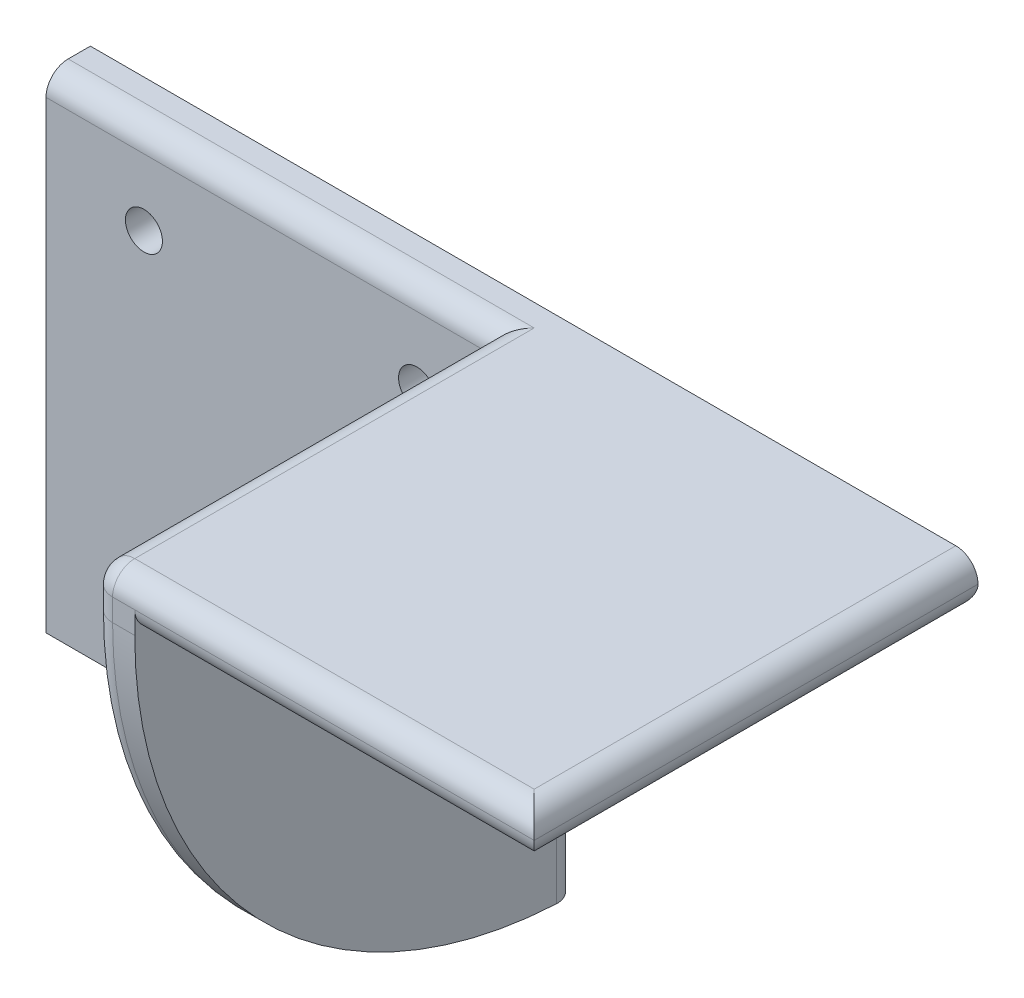
ISO-10303-21;
HEADER;
FILE_DESCRIPTION(('STEP AP214'),'2;1');
FILE_NAME('part.step','',(''),(''),'','','');
FILE_SCHEMA(('AUTOMOTIVE_DESIGN { 1 0 10303 214 1 1 1 1 }'));
ENDSEC;
DATA;
#1=APPLICATION_CONTEXT('core data for automotive mechanical design processes');
#2=APPLICATION_PROTOCOL_DEFINITION('international standard','automotive_design',2000,#1);
#3=PRODUCT_CONTEXT('',#1,'mechanical');
#4=PRODUCT('Part','Part','',(#3));
#5=PRODUCT_RELATED_PRODUCT_CATEGORY('part','',(#4));
#6=PRODUCT_DEFINITION_FORMATION('','',#4);
#7=PRODUCT_DEFINITION_CONTEXT('part definition',#1,'design');
#8=PRODUCT_DEFINITION('design','',#6,#7);
#9=PRODUCT_DEFINITION_SHAPE('','',#8);
#10=(LENGTH_UNIT() NAMED_UNIT(*) SI_UNIT(.MILLI.,.METRE.));
#11=(NAMED_UNIT(*) PLANE_ANGLE_UNIT() SI_UNIT($,.RADIAN.));
#12=(NAMED_UNIT(*) SI_UNIT($,.STERADIAN.) SOLID_ANGLE_UNIT());
#13=UNCERTAINTY_MEASURE_WITH_UNIT(LENGTH_MEASURE(1.E-05),#10,'distance_accuracy_value','');
#14=(GEOMETRIC_REPRESENTATION_CONTEXT(3) GLOBAL_UNCERTAINTY_ASSIGNED_CONTEXT((#13)) GLOBAL_UNIT_ASSIGNED_CONTEXT((#10,
#11,#12)) REPRESENTATION_CONTEXT('',''));
#15=CARTESIAN_POINT('',(0.,0.,0.));
#16=DIRECTION('',(0.,0.,1.));
#17=DIRECTION('',(1.,0.,0.));
#18=AXIS2_PLACEMENT_3D('',#15,#16,#17);
#19=CARTESIAN_POINT('',(-30.,6.,30.));
#20=DIRECTION('',(1.,0.,0.));
#21=DIRECTION('',(0.,0.,-1.));
#22=AXIS2_PLACEMENT_3D('',#19,#20,#21);
#23=PLANE('',#22);
#24=DIRECTION('',(0.,1.,0.));
#25=VECTOR('',#24,1.);
#26=CARTESIAN_POINT('',(-30.,6.,-24.));
#27=LINE('',#26,#25);
#28=CARTESIAN_POINT('',(-30.,-56.6833308830736,-24.));
#29=VERTEX_POINT('',#28);
#30=CARTESIAN_POINT('',(-30.,3.,-24.));
#31=VERTEX_POINT('',#30);
#32=EDGE_CURVE('E169',#29,#31,#27,.T.);
#33=ORIENTED_EDGE('',*,*,#32,.F.);
#34=CARTESIAN_POINT('',(-30.,0.,-30.));
#35=DIRECTION('',(1.,0.,0.));
#36=DIRECTION('',(0.,0.,-1.));
#37=AXIS2_PLACEMENT_3D('',#34,#35,#36);
#38=CIRCLE('',#37,57.);
#39=CARTESIAN_POINT('',(-30.,0.,27.));
#40=VERTEX_POINT('',#39);
#41=EDGE_CURVE('E357',#29,#40,#38,.F.);
#42=ORIENTED_EDGE('',*,*,#41,.T.);
#43=DIRECTION('',(0.,-1.,0.));
#44=VECTOR('',#43,1.);
#45=CARTESIAN_POINT('',(-30.,6.,27.));
#46=LINE('',#45,#44);
#47=CARTESIAN_POINT('',(-30.,3.,27.));
#48=VERTEX_POINT('',#47);
#49=EDGE_CURVE('E361',#40,#48,#46,.F.);
#50=ORIENTED_EDGE('',*,*,#49,.T.);
#51=DIRECTION('',(0.,0.,1.));
#52=VECTOR('',#51,1.);
#53=CARTESIAN_POINT('',(-30.,3.,30.));
#54=LINE('',#53,#52);
#55=EDGE_CURVE('E419',#48,#31,#54,.F.);
#56=ORIENTED_EDGE('',*,*,#55,.T.);
#57=EDGE_LOOP('',(#33,#42,#50,#56));
#58=FACE_BOUND('',#57,.T.);
#59=ADVANCED_FACE('F40',(#58),#23,.F.);
#60=CARTESIAN_POINT('',(-30.,6.,-30.));
#61=DIRECTION('',(0.,0.,1.));
#62=DIRECTION('',(1.,0.,0.));
#63=AXIS2_PLACEMENT_3D('',#60,#61,#62);
#64=PLANE('',#63);
#65=CARTESIAN_POINT('',(-39.8380749845108,-5.98781515653882,-30.));
#66=DIRECTION('',(0.,0.,1.));
#67=DIRECTION('',(1.,0.,0.));
#68=AXIS2_PLACEMENT_3D('',#65,#66,#67);
#69=CIRCLE('',#68,2.5);
#70=CARTESIAN_POINT('',(-37.3380749845108,-5.98781515653882,-30.));
#71=VERTEX_POINT('',#70);
#72=EDGE_CURVE('E298',#71,#71,#69,.T.);
#73=ORIENTED_EDGE('',*,*,#72,.T.);
#74=EDGE_LOOP('',(#73));
#75=FACE_BOUND('',#74,.T.);
#76=CARTESIAN_POINT('',(-76.7612206053908,-53.5992397729367,-30.));
#77=DIRECTION('',(0.,0.,1.));
#78=DIRECTION('',(1.,0.,0.));
#79=AXIS2_PLACEMENT_3D('',#76,#77,#78);
#80=CIRCLE('',#79,2.50000000000001);
#81=CARTESIAN_POINT('',(-74.2612206053908,-53.5992397729367,-30.));
#82=VERTEX_POINT('',#81);
#83=EDGE_CURVE('E302',#82,#82,#80,.T.);
#84=ORIENTED_EDGE('',*,*,#83,.T.);
#85=EDGE_LOOP('',(#84));
#86=FACE_BOUND('',#85,.T.);
#87=CARTESIAN_POINT('',(-39.8380749845108,-53.3563243412204,-30.));
#88=DIRECTION('',(0.,0.,1.));
#89=DIRECTION('',(1.,0.,0.));
#90=AXIS2_PLACEMENT_3D('',#87,#88,#89);
#91=CIRCLE('',#90,2.5);
#92=CARTESIAN_POINT('',(-37.3380749845108,-53.3563243412204,-30.));
#93=VERTEX_POINT('',#92);
#94=EDGE_CURVE('E306',#93,#93,#91,.T.);
#95=ORIENTED_EDGE('',*,*,#94,.T.);
#96=EDGE_LOOP('',(#95));
#97=FACE_BOUND('',#96,.T.);
#98=CARTESIAN_POINT('',(-76.7612206053908,-5.98781515653882,-30.));
#99=DIRECTION('',(0.,0.,1.));
#100=DIRECTION('',(1.,0.,0.));
#101=AXIS2_PLACEMENT_3D('',#98,#99,#100);
#102=CIRCLE('',#101,2.50000000000001);
#103=CARTESIAN_POINT('',(-74.2612206053908,-5.98781515653882,-30.));
#104=VERTEX_POINT('',#103);
#105=EDGE_CURVE('E174',#104,#104,#102,.T.);
#106=ORIENTED_EDGE('',*,*,#105,.T.);
#107=EDGE_LOOP('',(#106));
#108=FACE_BOUND('',#107,.T.);
#109=DIRECTION('',(-1.,0.,0.));
#110=VECTOR('',#109,1.);
#111=CARTESIAN_POINT('',(-30.,6.,-30.));
#112=LINE('',#111,#110);
#113=CARTESIAN_POINT('',(27.,6.,-30.));
#114=VERTEX_POINT('',#113);
#115=CARTESIAN_POINT('',(-90.,6.,-30.));
#116=VERTEX_POINT('',#115);
#117=EDGE_CURVE('E152',#114,#116,#112,.T.);
#118=ORIENTED_EDGE('',*,*,#117,.F.);
#119=CARTESIAN_POINT('',(27.,3.,-30.));
#120=DIRECTION('',(0.,0.,1.));
#121=DIRECTION('',(1.,0.,0.));
#122=AXIS2_PLACEMENT_3D('',#119,#120,#121);
#123=CIRCLE('',#122,3.);
#124=CARTESIAN_POINT('',(30.,3.,-30.));
#125=VERTEX_POINT('',#124);
#126=EDGE_CURVE('E50',#114,#125,#123,.F.);
#127=ORIENTED_EDGE('',*,*,#126,.T.);
#128=DIRECTION('',(-1.,0.,0.));
#129=VECTOR('',#128,1.);
#130=CARTESIAN_POINT('',(-24.,3.,-30.));
#131=LINE('',#130,#129);
#132=CARTESIAN_POINT('',(-27.,3.,-30.));
#133=VERTEX_POINT('',#132);
#134=EDGE_CURVE('E209',#125,#133,#131,.T.);
#135=ORIENTED_EDGE('',*,*,#134,.T.);
#136=DIRECTION('',(0.,1.,0.));
#137=VECTOR('',#136,1.);
#138=CARTESIAN_POINT('',(-27.,6.,-30.));
#139=LINE('',#138,#137);
#140=CARTESIAN_POINT('',(-27.,-60.,-30.));
#141=VERTEX_POINT('',#140);
#142=EDGE_CURVE('E159',#133,#141,#139,.F.);
#143=ORIENTED_EDGE('',*,*,#142,.T.);
#144=DIRECTION('',(1.,0.,0.));
#145=VECTOR('',#144,1.);
#146=CARTESIAN_POINT('',(-30.,-60.,-30.));
#147=LINE('',#146,#145);
#148=CARTESIAN_POINT('',(-90.,-60.,-30.));
#149=VERTEX_POINT('',#148);
#150=EDGE_CURVE('E143',#149,#141,#147,.T.);
#151=ORIENTED_EDGE('',*,*,#150,.F.);
#152=DIRECTION('',(0.,-1.,0.));
#153=VECTOR('',#152,1.);
#154=CARTESIAN_POINT('',(-90.,6.,-30.));
#155=LINE('',#154,#153);
#156=EDGE_CURVE('E157',#116,#149,#155,.T.);
#157=ORIENTED_EDGE('',*,*,#156,.F.);
#158=EDGE_LOOP('',(#118,#127,#135,#143,#151,#157));
#159=FACE_BOUND('',#158,.T.);
#160=ADVANCED_FACE('F156',(#75,#86,#97,#108,#159),#64,.F.);
#161=CARTESIAN_POINT('',(-30.,6.,30.));
#162=DIRECTION('',(0.,0.,-1.));
#163=DIRECTION('',(-1.,0.,0.));
#164=AXIS2_PLACEMENT_3D('',#161,#162,#163);
#165=PLANE('',#164);
#166=DIRECTION('',(1.,0.,0.));
#167=VECTOR('',#166,1.);
#168=CARTESIAN_POINT('',(-30.,3.,30.));
#169=LINE('',#168,#167);
#170=CARTESIAN_POINT('',(-24.,3.,30.));
#171=VERTEX_POINT('',#170);
#172=CARTESIAN_POINT('',(-27.,3.,30.));
#173=VERTEX_POINT('',#172);
#174=EDGE_CURVE('E372',#171,#173,#169,.F.);
#175=ORIENTED_EDGE('',*,*,#174,.T.);
#176=DIRECTION('',(0.,-1.,0.));
#177=VECTOR('',#176,1.);
#178=CARTESIAN_POINT('',(-27.,6.,30.));
#179=LINE('',#178,#177);
#180=CARTESIAN_POINT('',(-27.,0.,30.));
#181=VERTEX_POINT('',#180);
#182=EDGE_CURVE('E378',#173,#181,#179,.T.);
#183=ORIENTED_EDGE('',*,*,#182,.T.);
#184=DIRECTION('',(-1.,0.,0.));
#185=VECTOR('',#184,1.);
#186=CARTESIAN_POINT('',(-24.,0.,30.));
#187=LINE('',#186,#185);
#188=CARTESIAN_POINT('',(-24.,0.,30.));
#189=VERTEX_POINT('',#188);
#190=EDGE_CURVE('E189',#181,#189,#187,.F.);
#191=ORIENTED_EDGE('',*,*,#190,.T.);
#192=DIRECTION('',(0.,1.,0.));
#193=VECTOR('',#192,1.);
#194=CARTESIAN_POINT('',(-24.,6.,30.));
#195=LINE('',#194,#193);
#196=EDGE_CURVE('E401',#189,#171,#195,.T.);
#197=ORIENTED_EDGE('',*,*,#196,.T.);
#198=EDGE_LOOP('',(#175,#183,#191,#197));
#199=FACE_BOUND('',#198,.T.);
#200=ADVANCED_FACE('F282',(#199),#165,.F.);
#201=CARTESIAN_POINT('',(0.,6.,0.));
#202=DIRECTION('',(0.,-1.,0.));
#203=DIRECTION('',(0.,0.,-1.));
#204=AXIS2_PLACEMENT_3D('',#201,#202,#203);
#205=PLANE('',#204);
#206=DIRECTION('',(1.,0.,0.));
#207=VECTOR('',#206,1.);
#208=CARTESIAN_POINT('',(0.,6.,27.));
#209=LINE('',#208,#207);
#210=CARTESIAN_POINT('',(-27.,6.,27.));
#211=VERTEX_POINT('',#210);
#212=CARTESIAN_POINT('',(27.,6.,27.));
#213=VERTEX_POINT('',#212);
#214=EDGE_CURVE('E58',#211,#213,#209,.T.);
#215=ORIENTED_EDGE('',*,*,#214,.T.);
#216=DIRECTION('',(0.,0.,-1.));
#217=VECTOR('',#216,1.);
#218=CARTESIAN_POINT('',(27.,6.,0.));
#219=LINE('',#218,#217);
#220=EDGE_CURVE('E62',#213,#114,#219,.T.);
#221=ORIENTED_EDGE('',*,*,#220,.T.);
#222=ORIENTED_EDGE('',*,*,#117,.T.);
#223=DIRECTION('',(0.,0.,-1.));
#224=VECTOR('',#223,1.);
#225=CARTESIAN_POINT('',(-90.,6.,-30.));
#226=LINE('',#225,#224);
#227=CARTESIAN_POINT('',(-90.,6.,-27.));
#228=VERTEX_POINT('',#227);
#229=EDGE_CURVE('E166',#228,#116,#226,.T.);
#230=ORIENTED_EDGE('',*,*,#229,.F.);
#231=DIRECTION('',(1.,0.,0.));
#232=VECTOR('',#231,1.);
#233=CARTESIAN_POINT('',(0.,6.,-27.));
#234=LINE('',#233,#232);
#235=CARTESIAN_POINT('',(-27.,6.,-27.));
#236=VERTEX_POINT('',#235);
#237=EDGE_CURVE('E196',#228,#236,#234,.T.);
#238=ORIENTED_EDGE('',*,*,#237,.T.);
#239=DIRECTION('',(0.,0.,1.));
#240=VECTOR('',#239,1.);
#241=CARTESIAN_POINT('',(-27.,6.,0.));
#242=LINE('',#241,#240);
#243=EDGE_CURVE('E415',#236,#211,#242,.T.);
#244=ORIENTED_EDGE('',*,*,#243,.T.);
#245=EDGE_LOOP('',(#215,#221,#222,#230,#238,#244));
#246=FACE_BOUND('',#245,.T.);
#247=ADVANCED_FACE('F279',(#246),#205,.F.);
#248=CARTESIAN_POINT('',(0.,0.,0.));
#249=DIRECTION('',(0.,-1.,0.));
#250=DIRECTION('',(0.,0.,-1.));
#251=AXIS2_PLACEMENT_3D('',#248,#249,#250);
#252=PLANE('',#251);
#253=DIRECTION('',(0.,0.,1.));
#254=VECTOR('',#253,1.);
#255=CARTESIAN_POINT('',(-24.,0.,30.));
#256=LINE('',#255,#254);
#257=CARTESIAN_POINT('',(-24.,0.,-27.));
#258=VERTEX_POINT('',#257);
#259=CARTESIAN_POINT('',(-24.,0.,27.));
#260=VERTEX_POINT('',#259);
#261=EDGE_CURVE('E161',#258,#260,#256,.T.);
#262=ORIENTED_EDGE('',*,*,#261,.F.);
#263=DIRECTION('',(-1.,0.,0.));
#264=VECTOR('',#263,1.);
#265=CARTESIAN_POINT('',(30.,0.,-27.));
#266=LINE('',#265,#264);
#267=CARTESIAN_POINT('',(27.,0.,-27.));
#268=VERTEX_POINT('',#267);
#269=EDGE_CURVE('E402',#258,#268,#266,.F.);
#270=ORIENTED_EDGE('',*,*,#269,.T.);
#271=DIRECTION('',(0.,0.,-1.));
#272=VECTOR('',#271,1.);
#273=CARTESIAN_POINT('',(27.,0.,30.));
#274=LINE('',#273,#272);
#275=CARTESIAN_POINT('',(27.,0.,27.));
#276=VERTEX_POINT('',#275);
#277=EDGE_CURVE('E396',#268,#276,#274,.F.);
#278=ORIENTED_EDGE('',*,*,#277,.T.);
#279=DIRECTION('',(1.,0.,0.));
#280=VECTOR('',#279,1.);
#281=CARTESIAN_POINT('',(-24.,0.,27.));
#282=LINE('',#281,#280);
#283=EDGE_CURVE('E223',#276,#260,#282,.F.);
#284=ORIENTED_EDGE('',*,*,#283,.T.);
#285=EDGE_LOOP('',(#262,#270,#278,#284));
#286=FACE_BOUND('',#285,.T.);
#287=ADVANCED_FACE('F277',(#286),#252,.T.);
#288=CARTESIAN_POINT('',(-24.,-60.,30.));
#289=DIRECTION('',(-1.,0.,0.));
#290=DIRECTION('',(0.,0.,1.));
#291=AXIS2_PLACEMENT_3D('',#288,#289,#290);
#292=PLANE('',#291);
#293=CARTESIAN_POINT('',(-24.,0.,-30.));
#294=DIRECTION('',(-1.,0.,0.));
#295=DIRECTION('',(0.,0.,1.));
#296=AXIS2_PLACEMENT_3D('',#293,#294,#295);
#297=CIRCLE('',#296,60.);
#298=CARTESIAN_POINT('',(-24.,-59.9249530663145,-27.));
#299=VERTEX_POINT('',#298);
#300=EDGE_CURVE('E192',#189,#299,#297,.F.);
#301=ORIENTED_EDGE('',*,*,#300,.T.);
#302=DIRECTION('',(0.,1.,0.));
#303=VECTOR('',#302,1.);
#304=CARTESIAN_POINT('',(-24.,-60.,-27.));
#305=LINE('',#304,#303);
#306=EDGE_CURVE('E205',#299,#258,#305,.T.);
#307=ORIENTED_EDGE('',*,*,#306,.T.);
#308=ORIENTED_EDGE('',*,*,#261,.T.);
#309=CARTESIAN_POINT('',(-24.,3.,27.));
#310=DIRECTION('',(-1.,0.,0.));
#311=DIRECTION('',(0.,0.,1.));
#312=AXIS2_PLACEMENT_3D('',#309,#310,#311);
#313=CIRCLE('',#312,3.);
#314=EDGE_CURVE('E413',#260,#171,#313,.T.);
#315=ORIENTED_EDGE('',*,*,#314,.T.);
#316=ORIENTED_EDGE('',*,*,#196,.F.);
#317=EDGE_LOOP('',(#301,#307,#308,#315,#316));
#318=FACE_BOUND('',#317,.T.);
#319=ADVANCED_FACE('F272',(#318),#292,.F.);
#320=CARTESIAN_POINT('',(-90.,6.,-24.));
#321=DIRECTION('',(0.,0.,-1.));
#322=DIRECTION('',(-1.,0.,0.));
#323=AXIS2_PLACEMENT_3D('',#320,#321,#322);
#324=PLANE('',#323);
#325=CARTESIAN_POINT('',(-39.8380749845108,-5.98781515653882,-24.));
#326=DIRECTION('',(0.,0.,1.));
#327=DIRECTION('',(1.,0.,0.));
#328=AXIS2_PLACEMENT_3D('',#325,#326,#327);
#329=CIRCLE('',#328,2.5);
#330=CARTESIAN_POINT('',(-37.3380749845108,-5.98781515653882,-24.));
#331=VERTEX_POINT('',#330);
#332=EDGE_CURVE('E320',#331,#331,#329,.T.);
#333=ORIENTED_EDGE('',*,*,#332,.F.);
#334=EDGE_LOOP('',(#333));
#335=FACE_BOUND('',#334,.T.);
#336=CARTESIAN_POINT('',(-76.7612206053908,-53.5992397729367,-24.));
#337=DIRECTION('',(0.,0.,1.));
#338=DIRECTION('',(1.,0.,0.));
#339=AXIS2_PLACEMENT_3D('',#336,#337,#338);
#340=CIRCLE('',#339,2.50000000000001);
#341=CARTESIAN_POINT('',(-74.2612206053908,-53.5992397729367,-24.));
#342=VERTEX_POINT('',#341);
#343=EDGE_CURVE('E314',#342,#342,#340,.T.);
#344=ORIENTED_EDGE('',*,*,#343,.F.);
#345=EDGE_LOOP('',(#344));
#346=FACE_BOUND('',#345,.T.);
#347=CARTESIAN_POINT('',(-39.8380749845108,-53.3563243412204,-24.));
#348=DIRECTION('',(0.,0.,1.));
#349=DIRECTION('',(1.,0.,0.));
#350=AXIS2_PLACEMENT_3D('',#347,#348,#349);
#351=CIRCLE('',#350,2.5);
#352=CARTESIAN_POINT('',(-37.3380749845108,-53.3563243412204,-24.));
#353=VERTEX_POINT('',#352);
#354=EDGE_CURVE('E326',#353,#353,#351,.T.);
#355=ORIENTED_EDGE('',*,*,#354,.F.);
#356=EDGE_LOOP('',(#355));
#357=FACE_BOUND('',#356,.T.);
#358=CARTESIAN_POINT('',(-76.7612206053908,-5.98781515653882,-24.));
#359=DIRECTION('',(0.,0.,1.));
#360=DIRECTION('',(1.,0.,0.));
#361=AXIS2_PLACEMENT_3D('',#358,#359,#360);
#362=CIRCLE('',#361,2.50000000000001);
#363=CARTESIAN_POINT('',(-74.2612206053908,-5.98781515653882,-24.));
#364=VERTEX_POINT('',#363);
#365=EDGE_CURVE('E177',#364,#364,#362,.T.);
#366=ORIENTED_EDGE('',*,*,#365,.F.);
#367=EDGE_LOOP('',(#366));
#368=FACE_BOUND('',#367,.T.);
#369=DIRECTION('',(1.,0.,0.));
#370=VECTOR('',#369,1.);
#371=CARTESIAN_POINT('',(-90.,-59.6992462263972,-24.));
#372=LINE('',#371,#370);
#373=CARTESIAN_POINT('',(-90.,-59.6992462263972,-24.));
#374=VERTEX_POINT('',#373);
#375=CARTESIAN_POINT('',(-27.,-59.6992462263972,-24.));
#376=VERTEX_POINT('',#375);
#377=EDGE_CURVE('E146',#374,#376,#372,.T.);
#378=ORIENTED_EDGE('',*,*,#377,.T.);
#379=CARTESIAN_POINT('',(-27.,-59.6992462263972,-24.));
#380=CARTESIAN_POINT('',(-27.0840679412996,-59.6992545648546,-24.));
#381=CARTESIAN_POINT('',(-27.1681319263133,-59.6956947573301,-24.));
#382=CARTESIAN_POINT('',(-27.3356561646389,-59.6815033243546,-24.));
#383=CARTESIAN_POINT('',(-27.4191164524032,-59.6708721057326,-24.));
#384=CARTESIAN_POINT('',(-27.5847733393088,-59.6426149242573,-24.));
#385=CARTESIAN_POINT('',(-27.6669709996589,-59.6249952117223,-24.));
#386=CARTESIAN_POINT('',(-27.8295693639574,-59.5829075774079,-24.));
#387=CARTESIAN_POINT('',(-27.9099700865748,-59.5584397268122,-24.));
#388=CARTESIAN_POINT('',(-28.1476944998591,-59.4749712035964,-24.));
#389=CARTESIAN_POINT('',(-28.3016159485823,-59.4058926018362,-24.));
#390=CARTESIAN_POINT('',(-28.5956016026662,-59.242972373237,-24.));
#391=CARTESIAN_POINT('',(-28.7356677123405,-59.1491341559435,-24.));
#392=CARTESIAN_POINT('',(-28.9984493175101,-58.9391394131622,-24.));
#393=CARTESIAN_POINT('',(-29.1211271395701,-58.8229356762981,-24.));
#394=CARTESIAN_POINT('',(-29.3453622807689,-58.5716459664221,-24.));
#395=CARTESIAN_POINT('',(-29.4469153112062,-58.4365561684999,-24.));
#396=CARTESIAN_POINT('',(-29.6265333506082,-58.1506494891051,-24.));
#397=CARTESIAN_POINT('',(-29.7044793548183,-57.9997579213162,-24.));
#398=CARTESIAN_POINT('',(-29.8340361538481,-57.6871002786585,-24.));
#399=CARTESIAN_POINT('',(-29.8856602731936,-57.5253397528479,-24.));
#400=CARTESIAN_POINT('',(-29.9488793354195,-57.2494563913502,-24.));
#401=CARTESIAN_POINT('',(-29.9680387339994,-57.1370072058581,-24.));
#402=CARTESIAN_POINT('',(-29.993597802028,-56.9108305279191,-24.));
#403=CARTESIAN_POINT('',(-30.0000156101864,-56.7971050847726,-24.));
#404=CARTESIAN_POINT('',(-30.,-56.6833308830736,-24.));
#405=B_SPLINE_CURVE_WITH_KNOTS('',3,(#379,#380,#381,#382,#383,#384,#385,#386,#387,#388,#389,
#390,#391,#392,#393,#394,#395,#396,#397,#398,#399,#400,#401,#402,#403,#404),.UNSPECIFIED.,.F.,
.F.,(4,2,2,2,2,2,2,2,2,2,2,2,4),(0.,0.252121381195793,0.504228258723284,0.756110165344048,
1.00798945385533,1.51152107745333,2.01498339792416,2.5195203698123,3.02415967176115,
3.53130210415543,4.03818755806165,4.37972082189966,4.72076753521293),.UNSPECIFIED.);
#406=EDGE_CURVE('E11',#376,#29,#405,.T.);
#407=ORIENTED_EDGE('',*,*,#406,.T.);
#408=ORIENTED_EDGE('',*,*,#32,.T.);
#409=DIRECTION('',(1.,0.,0.));
#410=VECTOR('',#409,1.);
#411=CARTESIAN_POINT('',(-90.,3.,-24.));
#412=LINE('',#411,#410);
#413=CARTESIAN_POINT('',(-90.,3.,-24.));
#414=VERTEX_POINT('',#413);
#415=EDGE_CURVE('E199',#31,#414,#412,.F.);
#416=ORIENTED_EDGE('',*,*,#415,.T.);
#417=DIRECTION('',(0.,1.,0.));
#418=VECTOR('',#417,1.);
#419=CARTESIAN_POINT('',(-90.,6.,-24.));
#420=LINE('',#419,#418);
#421=EDGE_CURVE('E168',#374,#414,#420,.T.);
#422=ORIENTED_EDGE('',*,*,#421,.F.);
#423=EDGE_LOOP('',(#378,#407,#408,#416,#422));
#424=FACE_BOUND('',#423,.T.);
#425=ADVANCED_FACE('F267',(#335,#346,#357,#368,#424),#324,.F.);
#426=CARTESIAN_POINT('',(-90.,0.,0.));
#427=DIRECTION('',(-1.,0.,0.));
#428=DIRECTION('',(0.,0.,1.));
#429=AXIS2_PLACEMENT_3D('',#426,#427,#428);
#430=PLANE('',#429);
#431=ORIENTED_EDGE('',*,*,#421,.T.);
#432=CARTESIAN_POINT('',(-90.,3.,-27.));
#433=DIRECTION('',(-1.,0.,0.));
#434=DIRECTION('',(0.,0.,1.));
#435=AXIS2_PLACEMENT_3D('',#432,#433,#434);
#436=CIRCLE('',#435,3.);
#437=EDGE_CURVE('E202',#414,#228,#436,.T.);
#438=ORIENTED_EDGE('',*,*,#437,.T.);
#439=ORIENTED_EDGE('',*,*,#229,.T.);
#440=ORIENTED_EDGE('',*,*,#156,.T.);
#441=CARTESIAN_POINT('',(-90.,0.,-30.));
#442=DIRECTION('',(-1.,0.,0.));
#443=DIRECTION('',(0.,0.,1.));
#444=AXIS2_PLACEMENT_3D('',#441,#442,#443);
#445=CIRCLE('',#444,60.);
#446=EDGE_CURVE('E139',#149,#374,#445,.T.);
#447=ORIENTED_EDGE('',*,*,#446,.T.);
#448=EDGE_LOOP('',(#431,#438,#439,#440,#447));
#449=FACE_BOUND('',#448,.T.);
#450=ADVANCED_FACE('F164',(#449),#430,.T.);
#451=CARTESIAN_POINT('',(0.,0.,-30.));
#452=DIRECTION('',(1.,0.,0.));
#453=DIRECTION('',(0.,0.,-1.));
#454=AXIS2_PLACEMENT_3D('',#451,#452,#453);
#455=CYLINDRICAL_SURFACE('',#454,60.);
#456=ORIENTED_EDGE('',*,*,#190,.F.);
#457=CARTESIAN_POINT('',(-27.,0.,-30.));
#458=DIRECTION('',(1.,0.,0.));
#459=DIRECTION('',(0.,0.,-1.));
#460=AXIS2_PLACEMENT_3D('',#457,#458,#459);
#461=CIRCLE('',#460,60.);
#462=EDGE_CURVE('E358',#181,#376,#461,.T.);
#463=ORIENTED_EDGE('',*,*,#462,.T.);
#464=ORIENTED_EDGE('',*,*,#377,.F.);
#465=ORIENTED_EDGE('',*,*,#446,.F.);
#466=ORIENTED_EDGE('',*,*,#150,.T.);
#467=CARTESIAN_POINT('',(-27.,-60.,-30.));
#468=CARTESIAN_POINT('',(-26.9156222329019,-59.9999986741394,-30.0000080840676));
#469=CARTESIAN_POINT('',(-26.8312482981821,-59.9999999653804,-29.9964402251606));
#470=CARTESIAN_POINT('',(-26.6631040717739,-59.9999981363689,-29.982215181819));
#471=CARTESIAN_POINT('',(-26.5793337513874,-59.9999950163274,-29.9715583366973));
#472=CARTESIAN_POINT('',(-26.4130470110881,-59.9999747283949,-29.9432285129307));
#473=CARTESIAN_POINT('',(-26.3305296966716,-59.9999575710565,-29.9255608098548));
#474=CARTESIAN_POINT('',(-26.1672968154913,-59.9998902868103,-29.8833525835598));
#475=CARTESIAN_POINT('',(-26.0865812267429,-59.9998401603051,-29.8588121442511));
#476=CARTESIAN_POINT('',(-25.8479156327552,-59.9996048193302,-29.7750798924871));
#477=CARTESIAN_POINT('',(-25.6933793427168,-59.9993346713641,-29.7057655923958));
#478=CARTESIAN_POINT('',(-25.3982513625822,-59.9983089696641,-29.5422233588004));
#479=CARTESIAN_POINT('',(-25.2576572273162,-59.9975535012199,-29.4479998045356));
#480=CARTESIAN_POINT('',(-24.9942767133597,-59.9952444244042,-29.2372964314738));
#481=CARTESIAN_POINT('',(-24.8714883000543,-59.9936909073159,-29.1208191590836));
#482=CARTESIAN_POINT('',(-24.6471958604926,-59.9894693503809,-28.8688936562506));
#483=CARTESIAN_POINT('',(-24.5456957776694,-59.9868011043161,-28.7334419187303));
#484=CARTESIAN_POINT('',(-24.3669060360514,-59.9800814136868,-28.4474981453666));
#485=CARTESIAN_POINT('',(-24.289610410967,-59.9760303105056,-28.2970098280555));
#486=CARTESIAN_POINT('',(-24.1614081879161,-59.9663665463795,-27.9852709278242));
#487=CARTESIAN_POINT('',(-24.1104865915324,-59.9607547757541,-27.8240265207169));
#488=CARTESIAN_POINT('',(-24.0490355329382,-59.9501178843034,-27.5515032169753));
#489=CARTESIAN_POINT('',(-24.0306558290357,-59.945543969488,-27.4419118892762));
#490=CARTESIAN_POINT('',(-24.006139546634,-59.9357366056355,-27.2215567141169));
#491=CARTESIAN_POINT('',(-23.9999854896014,-59.9305041095516,-27.1107947684931));
#492=CARTESIAN_POINT('',(-24.,-59.9249530663145,-27.));
#493=B_SPLINE_CURVE_WITH_KNOTS('',3,(#467,#468,#469,#470,#471,#472,#473,#474,#475,#476,#477,
#478,#479,#480,#481,#482,#483,#484,#485,#486,#487,#488,#489,#490,#491,#492),.UNSPECIFIED.,.F.,
.F.,(4,2,2,2,2,2,2,2,2,2,2,2,4),(0.,0.253050983660394,0.506089855955527,0.758938680141724,
1.01178441738792,1.51727316021573,2.02267309324973,2.5280152299252,3.03345089325228,
3.53876187071504,4.04378517087588,4.37679650112252,4.70933139437203),.UNSPECIFIED.);
#494=EDGE_CURVE('E214',#141,#299,#493,.T.);
#495=ORIENTED_EDGE('',*,*,#494,.T.);
#496=ORIENTED_EDGE('',*,*,#300,.F.);
#497=EDGE_LOOP('',(#456,#463,#464,#465,#466,#495,#496));
#498=FACE_BOUND('',#497,.T.);
#499=ADVANCED_FACE('F142',(#498),#455,.T.);
#500=CARTESIAN_POINT('',(-76.7612206053908,-5.98781515653882,-30.));
#501=DIRECTION('',(0.,0.,1.));
#502=DIRECTION('',(1.,0.,0.));
#503=AXIS2_PLACEMENT_3D('',#500,#501,#502);
#504=CYLINDRICAL_SURFACE('',#503,2.50000000000001);
#505=ORIENTED_EDGE('',*,*,#105,.F.);
#506=EDGE_LOOP('',(#505));
#507=FACE_BOUND('',#506,.T.);
#508=ORIENTED_EDGE('',*,*,#365,.T.);
#509=EDGE_LOOP('',(#508));
#510=FACE_BOUND('',#509,.T.);
#511=ADVANCED_FACE('F506',(#507,#510),#504,.F.);
#512=CARTESIAN_POINT('',(-39.8380749845108,-53.3563243412204,-30.));
#513=DIRECTION('',(0.,0.,1.));
#514=DIRECTION('',(1.,0.,0.));
#515=AXIS2_PLACEMENT_3D('',#512,#513,#514);
#516=CYLINDRICAL_SURFACE('',#515,2.5);
#517=ORIENTED_EDGE('',*,*,#94,.F.);
#518=EDGE_LOOP('',(#517));
#519=FACE_BOUND('',#518,.T.);
#520=ORIENTED_EDGE('',*,*,#354,.T.);
#521=EDGE_LOOP('',(#520));
#522=FACE_BOUND('',#521,.T.);
#523=ADVANCED_FACE('F498',(#519,#522),#516,.F.);
#524=CARTESIAN_POINT('',(-76.7612206053908,-53.5992397729367,-30.));
#525=DIRECTION('',(0.,0.,1.));
#526=DIRECTION('',(1.,0.,0.));
#527=AXIS2_PLACEMENT_3D('',#524,#525,#526);
#528=CYLINDRICAL_SURFACE('',#527,2.50000000000001);
#529=ORIENTED_EDGE('',*,*,#83,.F.);
#530=EDGE_LOOP('',(#529));
#531=FACE_BOUND('',#530,.T.);
#532=ORIENTED_EDGE('',*,*,#343,.T.);
#533=EDGE_LOOP('',(#532));
#534=FACE_BOUND('',#533,.T.);
#535=ADVANCED_FACE('F489',(#531,#534),#528,.F.);
#536=CARTESIAN_POINT('',(-39.8380749845108,-5.98781515653882,-30.));
#537=DIRECTION('',(0.,0.,1.));
#538=DIRECTION('',(1.,0.,0.));
#539=AXIS2_PLACEMENT_3D('',#536,#537,#538);
#540=CYLINDRICAL_SURFACE('',#539,2.5);
#541=ORIENTED_EDGE('',*,*,#72,.F.);
#542=EDGE_LOOP('',(#541));
#543=FACE_BOUND('',#542,.T.);
#544=ORIENTED_EDGE('',*,*,#332,.T.);
#545=EDGE_LOOP('',(#544));
#546=FACE_BOUND('',#545,.T.);
#547=ADVANCED_FACE('F483',(#543,#546),#540,.F.);
#548=CARTESIAN_POINT('',(0.,3.,-27.));
#549=DIRECTION('',(1.,0.,0.));
#550=DIRECTION('',(0.,0.,-1.));
#551=AXIS2_PLACEMENT_3D('',#548,#549,#550);
#552=CYLINDRICAL_SURFACE('',#551,3.);
#553=ORIENTED_EDGE('',*,*,#437,.F.);
#554=ORIENTED_EDGE('',*,*,#415,.F.);
#555=CARTESIAN_POINT('',(-27.,3.,-27.));
#556=DIRECTION('',(0.707106781186547,0.,0.707106781186547));
#557=DIRECTION('',(-0.707106781186547,0.,0.707106781186547));
#558=AXIS2_PLACEMENT_3D('',#555,#556,#557);
#559=ELLIPSE('',#558,4.24264068711928,3.);
#560=EDGE_CURVE('E366',#31,#236,#559,.F.);
#561=ORIENTED_EDGE('',*,*,#560,.T.);
#562=ORIENTED_EDGE('',*,*,#237,.F.);
#563=EDGE_LOOP('',(#553,#554,#561,#562));
#564=FACE_BOUND('',#563,.T.);
#565=ADVANCED_FACE('F235',(#564),#552,.T.);
#566=CARTESIAN_POINT('',(-30.,3.,27.));
#567=DIRECTION('',(-1.,0.,0.));
#568=DIRECTION('',(0.,0.,1.));
#569=AXIS2_PLACEMENT_3D('',#566,#567,#568);
#570=CYLINDRICAL_SURFACE('',#569,3.);
#571=ORIENTED_EDGE('',*,*,#314,.F.);
#572=ORIENTED_EDGE('',*,*,#283,.F.);
#573=CARTESIAN_POINT('',(27.,3.,27.));
#574=DIRECTION('',(-0.707106781186548,0.,0.707106781186547));
#575=DIRECTION('',(-0.707106781186547,0.,-0.707106781186548));
#576=AXIS2_PLACEMENT_3D('',#573,#574,#575);
#577=ELLIPSE('',#576,4.24264068711929,3.);
#578=CARTESIAN_POINT('',(30.,3.,30.));
#579=VERTEX_POINT('',#578);
#580=EDGE_CURVE('E330',#579,#276,#577,.F.);
#581=ORIENTED_EDGE('',*,*,#580,.F.);
#582=DIRECTION('',(1.,0.,0.));
#583=VECTOR('',#582,1.);
#584=CARTESIAN_POINT('',(30.,3.,30.));
#585=LINE('',#584,#583);
#586=EDGE_CURVE('E407',#171,#579,#585,.T.);
#587=ORIENTED_EDGE('',*,*,#586,.F.);
#588=EDGE_LOOP('',(#571,#572,#581,#587));
#589=FACE_BOUND('',#588,.T.);
#590=ADVANCED_FACE('F242',(#589),#570,.T.);
#591=CARTESIAN_POINT('',(27.,3.,30.));
#592=DIRECTION('',(0.,0.,1.));
#593=DIRECTION('',(1.,0.,0.));
#594=AXIS2_PLACEMENT_3D('',#591,#592,#593);
#595=CYLINDRICAL_SURFACE('',#594,3.);
#596=ORIENTED_EDGE('',*,*,#580,.T.);
#597=ORIENTED_EDGE('',*,*,#277,.F.);
#598=CARTESIAN_POINT('',(27.,3.,-27.));
#599=DIRECTION('',(0.707106781186548,0.,0.707106781186547));
#600=DIRECTION('',(-0.707106781186547,0.,0.707106781186548));
#601=AXIS2_PLACEMENT_3D('',#598,#599,#600);
#602=ELLIPSE('',#601,4.24264068711929,3.);
#603=EDGE_CURVE('E335',#125,#268,#602,.F.);
#604=ORIENTED_EDGE('',*,*,#603,.F.);
#605=DIRECTION('',(0.,0.,-1.));
#606=VECTOR('',#605,1.);
#607=CARTESIAN_POINT('',(30.,3.,-30.));
#608=LINE('',#607,#606);
#609=EDGE_CURVE('E394',#579,#125,#608,.T.);
#610=ORIENTED_EDGE('',*,*,#609,.F.);
#611=EDGE_LOOP('',(#596,#597,#604,#610));
#612=FACE_BOUND('',#611,.T.);
#613=ADVANCED_FACE('F238',(#612),#595,.T.);
#614=CARTESIAN_POINT('',(-30.,3.,-27.));
#615=DIRECTION('',(1.,0.,0.));
#616=DIRECTION('',(0.,0.,-1.));
#617=AXIS2_PLACEMENT_3D('',#614,#615,#616);
#618=CYLINDRICAL_SURFACE('',#617,3.);
#619=ORIENTED_EDGE('',*,*,#603,.T.);
#620=ORIENTED_EDGE('',*,*,#269,.F.);
#621=CARTESIAN_POINT('',(-27.,3.,-27.));
#622=DIRECTION('',(0.707106781186547,0.707106781186547,0.));
#623=DIRECTION('',(-0.707106781186547,0.707106781186547,0.));
#624=AXIS2_PLACEMENT_3D('',#621,#622,#623);
#625=ELLIPSE('',#624,4.24264068711928,3.);
#626=EDGE_CURVE('E339',#133,#258,#625,.F.);
#627=ORIENTED_EDGE('',*,*,#626,.F.);
#628=ORIENTED_EDGE('',*,*,#134,.F.);
#629=EDGE_LOOP('',(#619,#620,#627,#628));
#630=FACE_BOUND('',#629,.T.);
#631=ADVANCED_FACE('F233',(#630),#618,.T.);
#632=CARTESIAN_POINT('',(-27.,-60.,-27.));
#633=DIRECTION('',(0.,1.,0.));
#634=DIRECTION('',(0.,0.,1.));
#635=AXIS2_PLACEMENT_3D('',#632,#633,#634);
#636=CYLINDRICAL_SURFACE('',#635,3.);
#637=ORIENTED_EDGE('',*,*,#494,.F.);
#638=ORIENTED_EDGE('',*,*,#142,.F.);
#639=ORIENTED_EDGE('',*,*,#626,.T.);
#640=ORIENTED_EDGE('',*,*,#306,.F.);
#641=EDGE_LOOP('',(#637,#638,#639,#640));
#642=FACE_BOUND('',#641,.T.);
#643=ADVANCED_FACE('F228',(#642),#636,.T.);
#644=CARTESIAN_POINT('',(-27.,3.,0.));
#645=DIRECTION('',(0.,0.,1.));
#646=DIRECTION('',(1.,0.,0.));
#647=AXIS2_PLACEMENT_3D('',#644,#645,#646);
#648=CYLINDRICAL_SURFACE('',#647,3.);
#649=ORIENTED_EDGE('',*,*,#55,.F.);
#650=CARTESIAN_POINT('',(-27.,3.,27.));
#651=DIRECTION('',(0.,0.,1.));
#652=DIRECTION('',(1.,0.,0.));
#653=AXIS2_PLACEMENT_3D('',#650,#651,#652);
#654=CIRCLE('',#653,3.);
#655=EDGE_CURVE('E381',#48,#211,#654,.F.);
#656=ORIENTED_EDGE('',*,*,#655,.T.);
#657=ORIENTED_EDGE('',*,*,#243,.F.);
#658=ORIENTED_EDGE('',*,*,#560,.F.);
#659=EDGE_LOOP('',(#649,#656,#657,#658));
#660=FACE_BOUND('',#659,.T.);
#661=ADVANCED_FACE('F232',(#660),#648,.T.);
#662=CARTESIAN_POINT('',(27.,3.,0.));
#663=DIRECTION('',(0.,0.,-1.));
#664=DIRECTION('',(-1.,0.,0.));
#665=AXIS2_PLACEMENT_3D('',#662,#663,#664);
#666=CYLINDRICAL_SURFACE('',#665,3.);
#667=ORIENTED_EDGE('',*,*,#126,.F.);
#668=ORIENTED_EDGE('',*,*,#220,.F.);
#669=CARTESIAN_POINT('',(27.,3.,27.));
#670=DIRECTION('',(0.707106781186548,0.,-0.707106781186547));
#671=DIRECTION('',(0.707106781186547,0.,0.707106781186548));
#672=AXIS2_PLACEMENT_3D('',#669,#670,#671);
#673=ELLIPSE('',#672,4.24264068711929,3.);
#674=EDGE_CURVE('E44',#579,#213,#673,.F.);
#675=ORIENTED_EDGE('',*,*,#674,.F.);
#676=ORIENTED_EDGE('',*,*,#609,.T.);
#677=EDGE_LOOP('',(#667,#668,#675,#676));
#678=FACE_BOUND('',#677,.T.);
#679=ADVANCED_FACE('F42',(#678),#666,.T.);
#680=CARTESIAN_POINT('',(0.,3.,27.));
#681=DIRECTION('',(1.,0.,0.));
#682=DIRECTION('',(0.,0.,-1.));
#683=AXIS2_PLACEMENT_3D('',#680,#681,#682);
#684=CYLINDRICAL_SURFACE('',#683,3.);
#685=ORIENTED_EDGE('',*,*,#674,.T.);
#686=ORIENTED_EDGE('',*,*,#214,.F.);
#687=CARTESIAN_POINT('',(-27.,3.,27.));
#688=DIRECTION('',(-1.,0.,0.));
#689=DIRECTION('',(0.,0.,1.));
#690=AXIS2_PLACEMENT_3D('',#687,#688,#689);
#691=CIRCLE('',#690,3.);
#692=EDGE_CURVE('E345',#173,#211,#691,.T.);
#693=ORIENTED_EDGE('',*,*,#692,.F.);
#694=ORIENTED_EDGE('',*,*,#174,.F.);
#695=ORIENTED_EDGE('',*,*,#586,.T.);
#696=EDGE_LOOP('',(#685,#686,#693,#694,#695));
#697=FACE_BOUND('',#696,.T.);
#698=ADVANCED_FACE('F432',(#697),#684,.T.);
#699=CARTESIAN_POINT('',(-27.,3.,27.));
#700=DIRECTION('',(0.,0.,-1.));
#701=DIRECTION('',(-1.,0.,0.));
#702=AXIS2_PLACEMENT_3D('',#699,#700,#701);
#703=SPHERICAL_SURFACE('',#702,3.);
#704=ORIENTED_EDGE('',*,*,#692,.T.);
#705=ORIENTED_EDGE('',*,*,#655,.F.);
#706=CARTESIAN_POINT('',(-27.,3.,27.));
#707=DIRECTION('',(0.,-1.,0.));
#708=DIRECTION('',(0.,0.,-1.));
#709=AXIS2_PLACEMENT_3D('',#706,#707,#708);
#710=CIRCLE('',#709,3.);
#711=EDGE_CURVE('E348',#173,#48,#710,.T.);
#712=ORIENTED_EDGE('',*,*,#711,.F.);
#713=EDGE_LOOP('',(#704,#705,#712));
#714=FACE_BOUND('',#713,.T.);
#715=ADVANCED_FACE('F435',(#714),#703,.T.);
#716=CARTESIAN_POINT('',(-27.,6.,27.));
#717=DIRECTION('',(0.,-1.,0.));
#718=DIRECTION('',(0.,0.,-1.));
#719=AXIS2_PLACEMENT_3D('',#716,#717,#718);
#720=CYLINDRICAL_SURFACE('',#719,3.);
#721=ORIENTED_EDGE('',*,*,#711,.T.);
#722=ORIENTED_EDGE('',*,*,#49,.F.);
#723=CARTESIAN_POINT('',(-27.,0.,27.));
#724=DIRECTION('',(0.,-1.,0.));
#725=DIRECTION('',(0.,0.,-1.));
#726=AXIS2_PLACEMENT_3D('',#723,#724,#725);
#727=CIRCLE('',#726,3.);
#728=EDGE_CURVE('E265',#181,#40,#727,.T.);
#729=ORIENTED_EDGE('',*,*,#728,.F.);
#730=ORIENTED_EDGE('',*,*,#182,.F.);
#731=EDGE_LOOP('',(#721,#722,#729,#730));
#732=FACE_BOUND('',#731,.T.);
#733=ADVANCED_FACE('F254',(#732),#720,.T.);
#734=CARTESIAN_POINT('',(-27.,0.,-30.));
#735=DIRECTION('',(1.,0.,0.));
#736=DIRECTION('',(0.,0.,-1.));
#737=AXIS2_PLACEMENT_3D('',#734,#735,#736);
#738=TOROIDAL_SURFACE('',#737,57.,3.);
#739=ORIENTED_EDGE('',*,*,#406,.F.);
#740=ORIENTED_EDGE('',*,*,#462,.F.);
#741=ORIENTED_EDGE('',*,*,#728,.T.);
#742=ORIENTED_EDGE('',*,*,#41,.F.);
#743=EDGE_LOOP('',(#739,#740,#741,#742));
#744=FACE_BOUND('',#743,.T.);
#745=ADVANCED_FACE('F250',(#744),#738,.T.);
#746=CLOSED_SHELL('',(#59,#160,#200,#247,#287,#319,#425,#450,#499,#511,#523,#535,#547,#565,#590,
#613,#631,#643,#661,#679,#698,#715,#733,#745));
#747=MANIFOLD_SOLID_BREP('B2',#746);
#748=ADVANCED_BREP_SHAPE_REPRESENTATION('',(#18,#747),#14);
#749=SHAPE_DEFINITION_REPRESENTATION(#9,#748);
ENDSEC;
END-ISO-10303-21;
